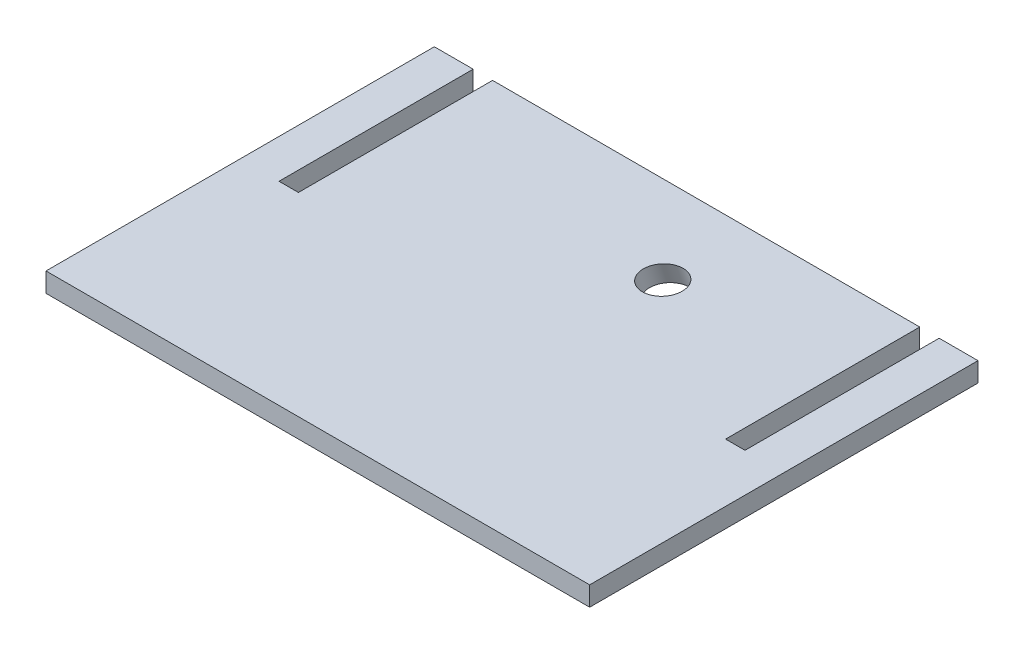
ISO-10303-21;
HEADER;
FILE_DESCRIPTION(('STEP AP214'),'2;1');
FILE_NAME('part.step','',(''),(''),'','','');
FILE_SCHEMA(('AUTOMOTIVE_DESIGN { 1 0 10303 214 1 1 1 1 }'));
ENDSEC;
DATA;
#1=APPLICATION_CONTEXT('core data for automotive mechanical design processes');
#2=APPLICATION_PROTOCOL_DEFINITION('international standard','automotive_design',2000,#1);
#3=PRODUCT_CONTEXT('',#1,'mechanical');
#4=PRODUCT('Part','Part','',(#3));
#5=PRODUCT_RELATED_PRODUCT_CATEGORY('part','',(#4));
#6=PRODUCT_DEFINITION_FORMATION('','',#4);
#7=PRODUCT_DEFINITION_CONTEXT('part definition',#1,'design');
#8=PRODUCT_DEFINITION('design','',#6,#7);
#9=PRODUCT_DEFINITION_SHAPE('','',#8);
#10=(LENGTH_UNIT() NAMED_UNIT(*) SI_UNIT(.MILLI.,.METRE.));
#11=(NAMED_UNIT(*) PLANE_ANGLE_UNIT() SI_UNIT($,.RADIAN.));
#12=(NAMED_UNIT(*) SI_UNIT($,.STERADIAN.) SOLID_ANGLE_UNIT());
#13=UNCERTAINTY_MEASURE_WITH_UNIT(LENGTH_MEASURE(1.E-05),#10,'distance_accuracy_value','');
#14=(GEOMETRIC_REPRESENTATION_CONTEXT(3) GLOBAL_UNCERTAINTY_ASSIGNED_CONTEXT((#13)) GLOBAL_UNIT_ASSIGNED_CONTEXT((#10,
#11,#12)) REPRESENTATION_CONTEXT('',''));
#15=CARTESIAN_POINT('',(0.,0.,0.));
#16=DIRECTION('',(0.,0.,1.));
#17=DIRECTION('',(1.,0.,0.));
#18=AXIS2_PLACEMENT_3D('',#15,#16,#17);
#19=CARTESIAN_POINT('',(-177.8,6.35,-127.));
#20=DIRECTION('',(0.,0.,1.));
#21=DIRECTION('',(1.,0.,0.));
#22=AXIS2_PLACEMENT_3D('',#19,#20,#21);
#23=PLANE('',#22);
#24=DIRECTION('',(-1.,0.,0.));
#25=VECTOR('',#24,1.);
#26=CARTESIAN_POINT('',(-177.8,6.35,-127.));
#27=LINE('',#26,#25);
#28=CARTESIAN_POINT('',(-152.4,6.35,-127.));
#29=VERTEX_POINT('',#28);
#30=CARTESIAN_POINT('',(-177.8,6.35,-127.));
#31=VERTEX_POINT('',#30);
#32=EDGE_CURVE('E195',#29,#31,#27,.T.);
#33=ORIENTED_EDGE('',*,*,#32,.F.);
#34=DIRECTION('',(0.,1.,0.));
#35=VECTOR('',#34,1.);
#36=CARTESIAN_POINT('',(-152.4,-6.35,-127.));
#37=LINE('',#36,#35);
#38=CARTESIAN_POINT('',(-152.4,-6.35,-127.));
#39=VERTEX_POINT('',#38);
#40=EDGE_CURVE('E181',#39,#29,#37,.T.);
#41=ORIENTED_EDGE('',*,*,#40,.F.);
#42=DIRECTION('',(-1.,0.,0.));
#43=VECTOR('',#42,1.);
#44=CARTESIAN_POINT('',(-177.8,-6.35,-127.));
#45=LINE('',#44,#43);
#46=CARTESIAN_POINT('',(-177.8,-6.35,-127.));
#47=VERTEX_POINT('',#46);
#48=EDGE_CURVE('E229',#39,#47,#45,.T.);
#49=ORIENTED_EDGE('',*,*,#48,.T.);
#50=DIRECTION('',(0.,-1.,0.));
#51=VECTOR('',#50,1.);
#52=CARTESIAN_POINT('',(-177.8,6.35,-127.));
#53=LINE('',#52,#51);
#54=EDGE_CURVE('E218',#31,#47,#53,.T.);
#55=ORIENTED_EDGE('',*,*,#54,.F.);
#56=EDGE_LOOP('',(#33,#41,#49,#55));
#57=FACE_BOUND('',#56,.T.);
#58=ADVANCED_FACE('F39',(#57),#23,.F.);
#59=CARTESIAN_POINT('',(139.7,-6.35,-127.));
#60=VERTEX_POINT('',#59);
#61=CARTESIAN_POINT('',(-139.7,-6.35,-127.));
#62=VERTEX_POINT('',#61);
#63=EDGE_CURVE('E180',#60,#62,#45,.T.);
#64=ORIENTED_EDGE('',*,*,#63,.T.);
#65=DIRECTION('',(0.,1.,0.));
#66=VECTOR('',#65,1.);
#67=CARTESIAN_POINT('',(-139.7,-6.35,-127.));
#68=LINE('',#67,#66);
#69=CARTESIAN_POINT('',(-139.7,6.35,-127.));
#70=VERTEX_POINT('',#69);
#71=EDGE_CURVE('E74',#62,#70,#68,.T.);
#72=ORIENTED_EDGE('',*,*,#71,.T.);
#73=CARTESIAN_POINT('',(139.7,6.35,-127.));
#74=VERTEX_POINT('',#73);
#75=EDGE_CURVE('E191',#74,#70,#27,.T.);
#76=ORIENTED_EDGE('',*,*,#75,.F.);
#77=DIRECTION('',(0.,1.,0.));
#78=VECTOR('',#77,1.);
#79=CARTESIAN_POINT('',(139.7,-6.35,-127.));
#80=LINE('',#79,#78);
#81=EDGE_CURVE('E164',#60,#74,#80,.T.);
#82=ORIENTED_EDGE('',*,*,#81,.F.);
#83=EDGE_LOOP('',(#64,#72,#76,#82));
#84=FACE_BOUND('',#83,.T.);
#85=ADVANCED_FACE('F255',(#84),#23,.F.);
#86=CARTESIAN_POINT('',(177.8,6.35,-127.));
#87=DIRECTION('',(-1.,0.,0.));
#88=DIRECTION('',(0.,0.,1.));
#89=AXIS2_PLACEMENT_3D('',#86,#87,#88);
#90=PLANE('',#89);
#91=DIRECTION('',(0.,0.,-1.));
#92=VECTOR('',#91,1.);
#93=CARTESIAN_POINT('',(177.8,-6.35,-127.));
#94=LINE('',#93,#92);
#95=CARTESIAN_POINT('',(177.8,-6.35,127.));
#96=VERTEX_POINT('',#95);
#97=CARTESIAN_POINT('',(177.8,-6.35,-127.));
#98=VERTEX_POINT('',#97);
#99=EDGE_CURVE('E179',#96,#98,#94,.T.);
#100=ORIENTED_EDGE('',*,*,#99,.T.);
#101=DIRECTION('',(0.,-1.,0.));
#102=VECTOR('',#101,1.);
#103=CARTESIAN_POINT('',(177.8,6.35,-127.));
#104=LINE('',#103,#102);
#105=CARTESIAN_POINT('',(177.8,6.35,-127.));
#106=VERTEX_POINT('',#105);
#107=EDGE_CURVE('E169',#106,#98,#104,.T.);
#108=ORIENTED_EDGE('',*,*,#107,.F.);
#109=DIRECTION('',(0.,0.,-1.));
#110=VECTOR('',#109,1.);
#111=CARTESIAN_POINT('',(177.8,6.35,-127.));
#112=LINE('',#111,#110);
#113=CARTESIAN_POINT('',(177.8,6.35,127.));
#114=VERTEX_POINT('',#113);
#115=EDGE_CURVE('E200',#114,#106,#112,.T.);
#116=ORIENTED_EDGE('',*,*,#115,.F.);
#117=DIRECTION('',(0.,-1.,0.));
#118=VECTOR('',#117,1.);
#119=CARTESIAN_POINT('',(177.8,6.35,127.));
#120=LINE('',#119,#118);
#121=EDGE_CURVE('E223',#114,#96,#120,.T.);
#122=ORIENTED_EDGE('',*,*,#121,.T.);
#123=EDGE_LOOP('',(#100,#108,#116,#122));
#124=FACE_BOUND('',#123,.T.);
#125=ADVANCED_FACE('F238',(#124),#90,.F.);
#126=CARTESIAN_POINT('',(152.4,-6.35,-127.));
#127=VERTEX_POINT('',#126);
#128=EDGE_CURVE('E170',#98,#127,#45,.T.);
#129=ORIENTED_EDGE('',*,*,#128,.T.);
#130=DIRECTION('',(0.,1.,0.));
#131=VECTOR('',#130,1.);
#132=CARTESIAN_POINT('',(152.4,-6.35,-127.));
#133=LINE('',#132,#131);
#134=CARTESIAN_POINT('',(152.4,6.35,-127.));
#135=VERTEX_POINT('',#134);
#136=EDGE_CURVE('E137',#127,#135,#133,.T.);
#137=ORIENTED_EDGE('',*,*,#136,.T.);
#138=EDGE_CURVE('E193',#106,#135,#27,.T.);
#139=ORIENTED_EDGE('',*,*,#138,.F.);
#140=ORIENTED_EDGE('',*,*,#107,.T.);
#141=EDGE_LOOP('',(#129,#137,#139,#140));
#142=FACE_BOUND('',#141,.T.);
#143=ADVANCED_FACE('F241',(#142),#23,.F.);
#144=CARTESIAN_POINT('',(-177.8,6.35,-127.));
#145=DIRECTION('',(1.,0.,0.));
#146=DIRECTION('',(0.,0.,-1.));
#147=AXIS2_PLACEMENT_3D('',#144,#145,#146);
#148=PLANE('',#147);
#149=DIRECTION('',(0.,0.,1.));
#150=VECTOR('',#149,1.);
#151=CARTESIAN_POINT('',(-177.8,-6.35,-127.));
#152=LINE('',#151,#150);
#153=CARTESIAN_POINT('',(-177.8,-6.35,127.));
#154=VERTEX_POINT('',#153);
#155=EDGE_CURVE('E226',#47,#154,#152,.T.);
#156=ORIENTED_EDGE('',*,*,#155,.T.);
#157=DIRECTION('',(0.,-1.,0.));
#158=VECTOR('',#157,1.);
#159=CARTESIAN_POINT('',(-177.8,6.35,127.));
#160=LINE('',#159,#158);
#161=CARTESIAN_POINT('',(-177.8,6.35,127.));
#162=VERTEX_POINT('',#161);
#163=EDGE_CURVE('E208',#162,#154,#160,.T.);
#164=ORIENTED_EDGE('',*,*,#163,.F.);
#165=DIRECTION('',(0.,0.,1.));
#166=VECTOR('',#165,1.);
#167=CARTESIAN_POINT('',(-177.8,6.35,-127.));
#168=LINE('',#167,#166);
#169=EDGE_CURVE('E202',#31,#162,#168,.T.);
#170=ORIENTED_EDGE('',*,*,#169,.F.);
#171=ORIENTED_EDGE('',*,*,#54,.T.);
#172=EDGE_LOOP('',(#156,#164,#170,#171));
#173=FACE_BOUND('',#172,.T.);
#174=ADVANCED_FACE('F245',(#173),#148,.F.);
#175=CARTESIAN_POINT('',(-177.8,6.35,127.));
#176=DIRECTION('',(0.,0.,-1.));
#177=DIRECTION('',(-1.,0.,0.));
#178=AXIS2_PLACEMENT_3D('',#175,#176,#177);
#179=PLANE('',#178);
#180=DIRECTION('',(1.,0.,0.));
#181=VECTOR('',#180,1.);
#182=CARTESIAN_POINT('',(-177.8,-6.35,127.));
#183=LINE('',#182,#181);
#184=EDGE_CURVE('E212',#154,#96,#183,.T.);
#185=ORIENTED_EDGE('',*,*,#184,.T.);
#186=ORIENTED_EDGE('',*,*,#121,.F.);
#187=DIRECTION('',(1.,0.,0.));
#188=VECTOR('',#187,1.);
#189=CARTESIAN_POINT('',(-177.8,6.35,127.));
#190=LINE('',#189,#188);
#191=EDGE_CURVE('E206',#162,#114,#190,.T.);
#192=ORIENTED_EDGE('',*,*,#191,.F.);
#193=ORIENTED_EDGE('',*,*,#163,.T.);
#194=EDGE_LOOP('',(#185,#186,#192,#193));
#195=FACE_BOUND('',#194,.T.);
#196=ADVANCED_FACE('F243',(#195),#179,.F.);
#197=CARTESIAN_POINT('',(0.,6.35,0.));
#198=DIRECTION('',(0.,1.,0.));
#199=DIRECTION('',(0.,0.,1.));
#200=AXIS2_PLACEMENT_3D('',#197,#198,#199);
#201=PLANE('',#200);
#202=CARTESIAN_POINT('',(29.06326332179,6.35,-69.5494140717771));
#203=DIRECTION('',(0.,1.,0.));
#204=DIRECTION('',(0.,0.,1.));
#205=AXIS2_PLACEMENT_3D('',#202,#203,#204);
#206=ELLIPSE('',#205,13.330179538405,12.7);
#207=CARTESIAN_POINT('',(29.0632633217901,6.35,-56.2192345333721));
#208=VERTEX_POINT('',#207);
#209=EDGE_CURVE('E43',#208,#208,#206,.F.);
#210=ORIENTED_EDGE('',*,*,#209,.T.);
#211=EDGE_LOOP('',(#210));
#212=FACE_BOUND('',#211,.T.);
#213=DIRECTION('',(0.,0.,1.));
#214=VECTOR('',#213,1.);
#215=CARTESIAN_POINT('',(-152.4,6.35,-127.));
#216=LINE('',#215,#214);
#217=CARTESIAN_POINT('',(-152.4,6.35,0.));
#218=VERTEX_POINT('',#217);
#219=EDGE_CURVE('E173',#29,#218,#216,.T.);
#220=ORIENTED_EDGE('',*,*,#219,.F.);
#221=ORIENTED_EDGE('',*,*,#32,.T.);
#222=ORIENTED_EDGE('',*,*,#169,.T.);
#223=ORIENTED_EDGE('',*,*,#191,.T.);
#224=ORIENTED_EDGE('',*,*,#115,.T.);
#225=ORIENTED_EDGE('',*,*,#138,.T.);
#226=DIRECTION('',(0.,0.,-1.));
#227=VECTOR('',#226,1.);
#228=CARTESIAN_POINT('',(152.4,6.35,-127.));
#229=LINE('',#228,#227);
#230=CARTESIAN_POINT('',(152.4,6.35,0.));
#231=VERTEX_POINT('',#230);
#232=EDGE_CURVE('E151',#231,#135,#229,.T.);
#233=ORIENTED_EDGE('',*,*,#232,.F.);
#234=DIRECTION('',(1.,0.,0.));
#235=VECTOR('',#234,1.);
#236=CARTESIAN_POINT('',(139.7,6.35,0.));
#237=LINE('',#236,#235);
#238=CARTESIAN_POINT('',(139.7,6.35,0.));
#239=VERTEX_POINT('',#238);
#240=EDGE_CURVE('E149',#239,#231,#237,.T.);
#241=ORIENTED_EDGE('',*,*,#240,.F.);
#242=DIRECTION('',(0.,0.,1.));
#243=VECTOR('',#242,1.);
#244=CARTESIAN_POINT('',(139.7,6.35,-127.));
#245=LINE('',#244,#243);
#246=EDGE_CURVE('E141',#74,#239,#245,.T.);
#247=ORIENTED_EDGE('',*,*,#246,.F.);
#248=ORIENTED_EDGE('',*,*,#75,.T.);
#249=DIRECTION('',(0.,0.,-1.));
#250=VECTOR('',#249,1.);
#251=CARTESIAN_POINT('',(-139.7,6.35,-127.));
#252=LINE('',#251,#250);
#253=CARTESIAN_POINT('',(-139.7,6.35,0.));
#254=VERTEX_POINT('',#253);
#255=EDGE_CURVE('E78',#254,#70,#252,.T.);
#256=ORIENTED_EDGE('',*,*,#255,.F.);
#257=DIRECTION('',(1.,0.,0.));
#258=VECTOR('',#257,1.);
#259=CARTESIAN_POINT('',(-152.4,6.35,0.));
#260=LINE('',#259,#258);
#261=EDGE_CURVE('E175',#218,#254,#260,.T.);
#262=ORIENTED_EDGE('',*,*,#261,.F.);
#263=EDGE_LOOP('',(#220,#221,#222,#223,#224,#225,#233,#241,#247,#248,#256,#262));
#264=FACE_BOUND('',#263,.T.);
#265=ADVANCED_FACE('F41',(#212,#264),#201,.T.);
#266=CARTESIAN_POINT('',(0.,-6.35,0.));
#267=DIRECTION('',(0.,1.,0.));
#268=DIRECTION('',(0.,0.,1.));
#269=AXIS2_PLACEMENT_3D('',#266,#267,#268);
#270=PLANE('',#269);
#271=CARTESIAN_POINT('',(29.06326332179,-6.35,-73.599560553833));
#272=DIRECTION('',(0.,1.,0.));
#273=DIRECTION('',(0.,0.,1.));
#274=AXIS2_PLACEMENT_3D('',#271,#272,#273);
#275=ELLIPSE('',#274,13.330179538405,12.7);
#276=CARTESIAN_POINT('',(29.0632633217901,-6.35,-60.2693810154281));
#277=VERTEX_POINT('',#276);
#278=EDGE_CURVE('E11',#277,#277,#275,.F.);
#279=ORIENTED_EDGE('',*,*,#278,.F.);
#280=EDGE_LOOP('',(#279));
#281=FACE_BOUND('',#280,.T.);
#282=ORIENTED_EDGE('',*,*,#48,.F.);
#283=DIRECTION('',(0.,0.,1.));
#284=VECTOR('',#283,1.);
#285=CARTESIAN_POINT('',(-152.4,-6.35,-127.));
#286=LINE('',#285,#284);
#287=CARTESIAN_POINT('',(-152.4,-6.35,0.));
#288=VERTEX_POINT('',#287);
#289=EDGE_CURVE('E189',#39,#288,#286,.T.);
#290=ORIENTED_EDGE('',*,*,#289,.T.);
#291=DIRECTION('',(1.,0.,0.));
#292=VECTOR('',#291,1.);
#293=CARTESIAN_POINT('',(-152.4,-6.35,0.));
#294=LINE('',#293,#292);
#295=CARTESIAN_POINT('',(-139.7,-6.35,0.));
#296=VERTEX_POINT('',#295);
#297=EDGE_CURVE('E187',#288,#296,#294,.T.);
#298=ORIENTED_EDGE('',*,*,#297,.T.);
#299=DIRECTION('',(0.,0.,-1.));
#300=VECTOR('',#299,1.);
#301=CARTESIAN_POINT('',(-139.7,-6.35,-127.));
#302=LINE('',#301,#300);
#303=EDGE_CURVE('E158',#296,#62,#302,.T.);
#304=ORIENTED_EDGE('',*,*,#303,.T.);
#305=ORIENTED_EDGE('',*,*,#63,.F.);
#306=DIRECTION('',(0.,0.,1.));
#307=VECTOR('',#306,1.);
#308=CARTESIAN_POINT('',(139.7,-6.35,-127.));
#309=LINE('',#308,#307);
#310=CARTESIAN_POINT('',(139.7,-6.35,0.));
#311=VERTEX_POINT('',#310);
#312=EDGE_CURVE('E156',#60,#311,#309,.T.);
#313=ORIENTED_EDGE('',*,*,#312,.T.);
#314=DIRECTION('',(1.,0.,0.));
#315=VECTOR('',#314,1.);
#316=CARTESIAN_POINT('',(139.7,-6.35,0.));
#317=LINE('',#316,#315);
#318=CARTESIAN_POINT('',(152.4,-6.35,0.));
#319=VERTEX_POINT('',#318);
#320=EDGE_CURVE('E142',#311,#319,#317,.T.);
#321=ORIENTED_EDGE('',*,*,#320,.T.);
#322=DIRECTION('',(0.,0.,-1.));
#323=VECTOR('',#322,1.);
#324=CARTESIAN_POINT('',(152.4,-6.35,-127.));
#325=LINE('',#324,#323);
#326=EDGE_CURVE('E131',#319,#127,#325,.T.);
#327=ORIENTED_EDGE('',*,*,#326,.T.);
#328=ORIENTED_EDGE('',*,*,#128,.F.);
#329=ORIENTED_EDGE('',*,*,#99,.F.);
#330=ORIENTED_EDGE('',*,*,#184,.F.);
#331=ORIENTED_EDGE('',*,*,#155,.F.);
#332=EDGE_LOOP('',(#282,#290,#298,#304,#305,#313,#321,#327,#328,#329,#330,#331));
#333=FACE_BOUND('',#332,.T.);
#334=ADVANCED_FACE('F154',(#281,#333),#270,.F.);
#335=CARTESIAN_POINT('',(139.7,-6.35,-127.));
#336=DIRECTION('',(-1.,0.,0.));
#337=DIRECTION('',(0.,0.,1.));
#338=AXIS2_PLACEMENT_3D('',#335,#336,#337);
#339=PLANE('',#338);
#340=ORIENTED_EDGE('',*,*,#246,.T.);
#341=DIRECTION('',(0.,1.,0.));
#342=VECTOR('',#341,1.);
#343=CARTESIAN_POINT('',(139.7,-6.35,0.));
#344=LINE('',#343,#342);
#345=EDGE_CURVE('E166',#311,#239,#344,.T.);
#346=ORIENTED_EDGE('',*,*,#345,.F.);
#347=ORIENTED_EDGE('',*,*,#312,.F.);
#348=ORIENTED_EDGE('',*,*,#81,.T.);
#349=EDGE_LOOP('',(#340,#346,#347,#348));
#350=FACE_BOUND('',#349,.T.);
#351=ADVANCED_FACE('F322',(#350),#339,.F.);
#352=CARTESIAN_POINT('',(152.4,-6.35,-127.));
#353=DIRECTION('',(1.,0.,0.));
#354=DIRECTION('',(0.,0.,-1.));
#355=AXIS2_PLACEMENT_3D('',#352,#353,#354);
#356=PLANE('',#355);
#357=ORIENTED_EDGE('',*,*,#232,.T.);
#358=ORIENTED_EDGE('',*,*,#136,.F.);
#359=ORIENTED_EDGE('',*,*,#326,.F.);
#360=DIRECTION('',(0.,1.,0.));
#361=VECTOR('',#360,1.);
#362=CARTESIAN_POINT('',(152.4,-6.35,0.));
#363=LINE('',#362,#361);
#364=EDGE_CURVE('E134',#319,#231,#363,.T.);
#365=ORIENTED_EDGE('',*,*,#364,.T.);
#366=EDGE_LOOP('',(#357,#358,#359,#365));
#367=FACE_BOUND('',#366,.T.);
#368=ADVANCED_FACE('F133',(#367),#356,.F.);
#369=CARTESIAN_POINT('',(139.7,-6.35,0.));
#370=DIRECTION('',(0.,0.,1.));
#371=DIRECTION('',(1.,0.,0.));
#372=AXIS2_PLACEMENT_3D('',#369,#370,#371);
#373=PLANE('',#372);
#374=ORIENTED_EDGE('',*,*,#240,.T.);
#375=ORIENTED_EDGE('',*,*,#364,.F.);
#376=ORIENTED_EDGE('',*,*,#320,.F.);
#377=ORIENTED_EDGE('',*,*,#345,.T.);
#378=EDGE_LOOP('',(#374,#375,#376,#377));
#379=FACE_BOUND('',#378,.T.);
#380=ADVANCED_FACE('F146',(#379),#373,.F.);
#381=CARTESIAN_POINT('',(-152.4,-6.35,-127.));
#382=DIRECTION('',(-1.,0.,0.));
#383=DIRECTION('',(0.,0.,1.));
#384=AXIS2_PLACEMENT_3D('',#381,#382,#383);
#385=PLANE('',#384);
#386=ORIENTED_EDGE('',*,*,#219,.T.);
#387=DIRECTION('',(0.,1.,0.));
#388=VECTOR('',#387,1.);
#389=CARTESIAN_POINT('',(-152.4,-6.35,0.));
#390=LINE('',#389,#388);
#391=EDGE_CURVE('E49',#288,#218,#390,.T.);
#392=ORIENTED_EDGE('',*,*,#391,.F.);
#393=ORIENTED_EDGE('',*,*,#289,.F.);
#394=ORIENTED_EDGE('',*,*,#40,.T.);
#395=EDGE_LOOP('',(#386,#392,#393,#394));
#396=FACE_BOUND('',#395,.T.);
#397=ADVANCED_FACE('F350',(#396),#385,.F.);
#398=CARTESIAN_POINT('',(-139.7,-6.35,-127.));
#399=DIRECTION('',(1.,0.,0.));
#400=DIRECTION('',(0.,0.,-1.));
#401=AXIS2_PLACEMENT_3D('',#398,#399,#400);
#402=PLANE('',#401);
#403=ORIENTED_EDGE('',*,*,#255,.T.);
#404=ORIENTED_EDGE('',*,*,#71,.F.);
#405=ORIENTED_EDGE('',*,*,#303,.F.);
#406=DIRECTION('',(0.,1.,0.));
#407=VECTOR('',#406,1.);
#408=CARTESIAN_POINT('',(-139.7,-6.35,0.));
#409=LINE('',#408,#407);
#410=EDGE_CURVE('E176',#296,#254,#409,.T.);
#411=ORIENTED_EDGE('',*,*,#410,.T.);
#412=EDGE_LOOP('',(#403,#404,#405,#411));
#413=FACE_BOUND('',#412,.T.);
#414=ADVANCED_FACE('F360',(#413),#402,.F.);
#415=CARTESIAN_POINT('',(-152.4,-6.35,0.));
#416=DIRECTION('',(0.,0.,1.));
#417=DIRECTION('',(1.,0.,0.));
#418=AXIS2_PLACEMENT_3D('',#415,#416,#417);
#419=PLANE('',#418);
#420=ORIENTED_EDGE('',*,*,#261,.T.);
#421=ORIENTED_EDGE('',*,*,#410,.F.);
#422=ORIENTED_EDGE('',*,*,#297,.F.);
#423=ORIENTED_EDGE('',*,*,#391,.T.);
#424=EDGE_LOOP('',(#420,#421,#422,#423));
#425=FACE_BOUND('',#424,.T.);
#426=ADVANCED_FACE('F371',(#425),#419,.F.);
#427=CARTESIAN_POINT('',(29.0632633217899,-44.4499999999978,-85.7500000000002));
#428=DIRECTION('',(0.,0.95272535252887,0.303832853142546));
#429=DIRECTION('',(0.,-0.303832853142546,0.95272535252887));
#430=AXIS2_PLACEMENT_3D('',#427,#428,#429);
#431=CYLINDRICAL_SURFACE('',#430,12.7);
#432=ORIENTED_EDGE('',*,*,#209,.F.);
#433=EDGE_LOOP('',(#432));
#434=FACE_BOUND('',#433,.T.);
#435=ORIENTED_EDGE('',*,*,#278,.T.);
#436=EDGE_LOOP('',(#435));
#437=FACE_BOUND('',#436,.T.);
#438=ADVANCED_FACE('F381',(#434,#437),#431,.F.);
#439=CLOSED_SHELL('',(#58,#85,#125,#143,#174,#196,#265,#334,#351,#368,#380,#397,#414,#426,#438));
#440=MANIFOLD_SOLID_BREP('B2',#439);
#441=ADVANCED_BREP_SHAPE_REPRESENTATION('',(#18,#440),#14);
#442=SHAPE_DEFINITION_REPRESENTATION(#9,#441);
ENDSEC;
END-ISO-10303-21;
